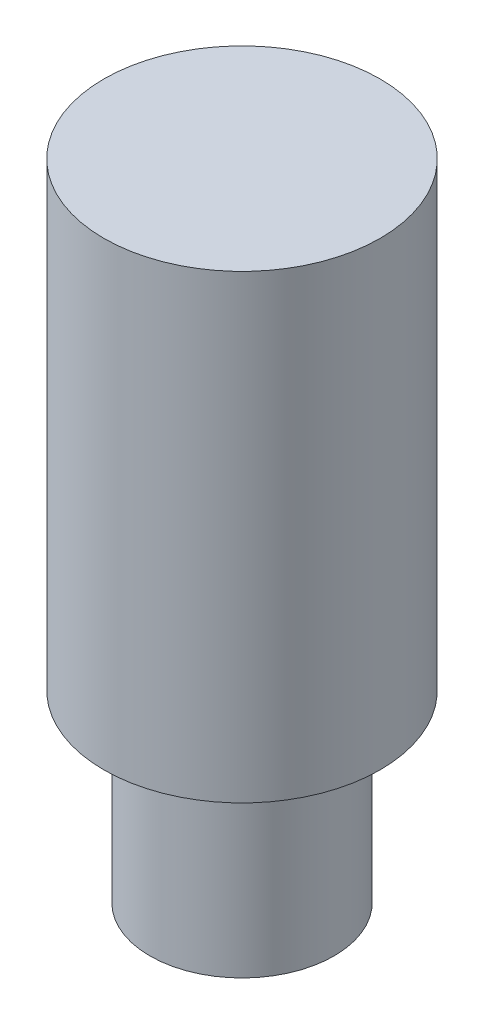
ISO-10303-21;
HEADER;
FILE_DESCRIPTION(('STEP AP214'),'2;1');
FILE_NAME('part.step','',(''),(''),'','','');
FILE_SCHEMA(('AUTOMOTIVE_DESIGN { 1 0 10303 214 1 1 1 1 }'));
ENDSEC;
DATA;
#1=APPLICATION_CONTEXT('core data for automotive mechanical design processes');
#2=APPLICATION_PROTOCOL_DEFINITION('international standard','automotive_design',2000,#1);
#3=PRODUCT_CONTEXT('',#1,'mechanical');
#4=PRODUCT('Part','Part','',(#3));
#5=PRODUCT_RELATED_PRODUCT_CATEGORY('part','',(#4));
#6=PRODUCT_DEFINITION_FORMATION('','',#4);
#7=PRODUCT_DEFINITION_CONTEXT('part definition',#1,'design');
#8=PRODUCT_DEFINITION('design','',#6,#7);
#9=PRODUCT_DEFINITION_SHAPE('','',#8);
#10=(LENGTH_UNIT() NAMED_UNIT(*) SI_UNIT(.MILLI.,.METRE.));
#11=(NAMED_UNIT(*) PLANE_ANGLE_UNIT() SI_UNIT($,.RADIAN.));
#12=(NAMED_UNIT(*) SI_UNIT($,.STERADIAN.) SOLID_ANGLE_UNIT());
#13=UNCERTAINTY_MEASURE_WITH_UNIT(LENGTH_MEASURE(1.E-05),#10,'distance_accuracy_value','');
#14=(GEOMETRIC_REPRESENTATION_CONTEXT(3) GLOBAL_UNCERTAINTY_ASSIGNED_CONTEXT((#13)) GLOBAL_UNIT_ASSIGNED_CONTEXT((#10,
#11,#12)) REPRESENTATION_CONTEXT('',''));
#15=CARTESIAN_POINT('',(0.,0.,0.));
#16=DIRECTION('',(0.,0.,1.));
#17=DIRECTION('',(1.,0.,0.));
#18=AXIS2_PLACEMENT_3D('',#15,#16,#17);
#19=CARTESIAN_POINT('',(0.,2.,0.));
#20=DIRECTION('',(0.,-1.,0.));
#21=DIRECTION('',(0.,0.,-1.));
#22=AXIS2_PLACEMENT_3D('',#19,#20,#21);
#23=CYLINDRICAL_SURFACE('',#22,1.);
#24=CARTESIAN_POINT('',(0.,2.,0.));
#25=DIRECTION('',(0.,1.,0.));
#26=DIRECTION('',(0.,0.,1.));
#27=AXIS2_PLACEMENT_3D('',#24,#25,#26);
#28=CIRCLE('',#27,1.);
#29=CARTESIAN_POINT('',(0.,2.,1.));
#30=VERTEX_POINT('',#29);
#31=EDGE_CURVE('E10',#30,#30,#28,.T.);
#32=ORIENTED_EDGE('',*,*,#31,.F.);
#33=EDGE_LOOP('',(#32));
#34=FACE_BOUND('',#33,.T.);
#35=CARTESIAN_POINT('',(0.,0.,0.));
#36=DIRECTION('',(0.,1.,0.));
#37=DIRECTION('',(0.,0.,1.));
#38=AXIS2_PLACEMENT_3D('',#35,#36,#37);
#39=CIRCLE('',#38,1.);
#40=CARTESIAN_POINT('',(0.,0.,1.));
#41=VERTEX_POINT('',#40);
#42=EDGE_CURVE('E40',#41,#41,#39,.T.);
#43=ORIENTED_EDGE('',*,*,#42,.T.);
#44=EDGE_LOOP('',(#43));
#45=FACE_BOUND('',#44,.T.);
#46=ADVANCED_FACE('F37',(#34,#45),#23,.T.);
#47=CARTESIAN_POINT('',(0.,0.,0.));
#48=DIRECTION('',(0.,1.,0.));
#49=DIRECTION('',(0.,0.,1.));
#50=AXIS2_PLACEMENT_3D('',#47,#48,#49);
#51=PLANE('',#50);
#52=ORIENTED_EDGE('',*,*,#42,.F.);
#53=EDGE_LOOP('',(#52));
#54=FACE_BOUND('',#53,.T.);
#55=ADVANCED_FACE('F64',(#54),#51,.F.);
#56=CARTESIAN_POINT('',(0.,7.,0.));
#57=DIRECTION('',(0.,-1.,0.));
#58=DIRECTION('',(0.,0.,-1.));
#59=AXIS2_PLACEMENT_3D('',#56,#57,#58);
#60=CYLINDRICAL_SURFACE('',#59,1.5);
#61=CARTESIAN_POINT('',(0.,7.,0.));
#62=DIRECTION('',(0.,1.,0.));
#63=DIRECTION('',(0.,0.,1.));
#64=AXIS2_PLACEMENT_3D('',#61,#62,#63);
#65=CIRCLE('',#64,1.5);
#66=CARTESIAN_POINT('',(0.,7.,1.5));
#67=VERTEX_POINT('',#66);
#68=EDGE_CURVE('E49',#67,#67,#65,.T.);
#69=ORIENTED_EDGE('',*,*,#68,.F.);
#70=EDGE_LOOP('',(#69));
#71=FACE_BOUND('',#70,.T.);
#72=CARTESIAN_POINT('',(0.,2.,0.));
#73=DIRECTION('',(0.,1.,0.));
#74=DIRECTION('',(0.,0.,1.));
#75=AXIS2_PLACEMENT_3D('',#72,#73,#74);
#76=CIRCLE('',#75,1.5);
#77=CARTESIAN_POINT('',(0.,2.,1.5));
#78=VERTEX_POINT('',#77);
#79=EDGE_CURVE('E51',#78,#78,#76,.T.);
#80=ORIENTED_EDGE('',*,*,#79,.T.);
#81=EDGE_LOOP('',(#80));
#82=FACE_BOUND('',#81,.T.);
#83=ADVANCED_FACE('F61',(#71,#82),#60,.T.);
#84=CARTESIAN_POINT('',(0.,7.,0.));
#85=DIRECTION('',(0.,1.,0.));
#86=DIRECTION('',(0.,0.,1.));
#87=AXIS2_PLACEMENT_3D('',#84,#85,#86);
#88=PLANE('',#87);
#89=ORIENTED_EDGE('',*,*,#68,.T.);
#90=EDGE_LOOP('',(#89));
#91=FACE_BOUND('',#90,.T.);
#92=ADVANCED_FACE('F59',(#91),#88,.T.);
#93=CARTESIAN_POINT('',(0.,2.,0.));
#94=DIRECTION('',(0.,1.,0.));
#95=DIRECTION('',(0.,0.,1.));
#96=AXIS2_PLACEMENT_3D('',#93,#94,#95);
#97=PLANE('',#96);
#98=ORIENTED_EDGE('',*,*,#31,.T.);
#99=EDGE_LOOP('',(#98));
#100=FACE_BOUND('',#99,.T.);
#101=ORIENTED_EDGE('',*,*,#79,.F.);
#102=EDGE_LOOP('',(#101));
#103=FACE_BOUND('',#102,.T.);
#104=ADVANCED_FACE('F68',(#100,#103),#97,.F.);
#105=CLOSED_SHELL('',(#46,#55,#83,#92,#104));
#106=MANIFOLD_SOLID_BREP('B2',#105);
#107=ADVANCED_BREP_SHAPE_REPRESENTATION('',(#18,#106),#14);
#108=SHAPE_DEFINITION_REPRESENTATION(#9,#107);
ENDSEC;
END-ISO-10303-21;
